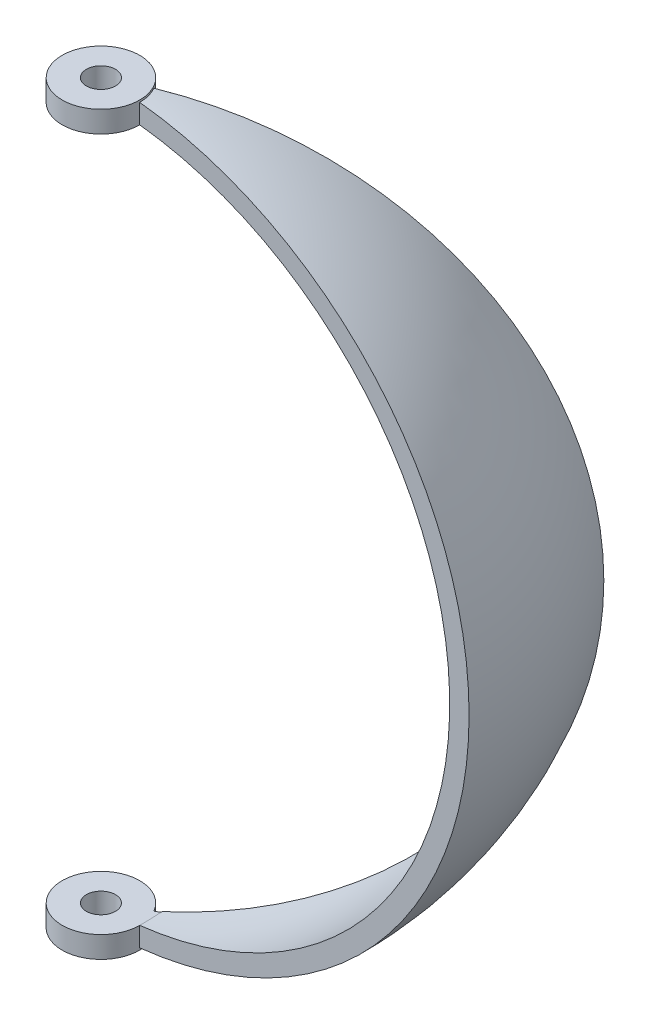
ISO-10303-21;
HEADER;
FILE_DESCRIPTION(('STEP AP214'),'2;1');
FILE_NAME('part.step','',(''),(''),'','','');
FILE_SCHEMA(('AUTOMOTIVE_DESIGN { 1 0 10303 214 1 1 1 1 }'));
ENDSEC;
DATA;
#1=APPLICATION_CONTEXT('core data for automotive mechanical design processes');
#2=APPLICATION_PROTOCOL_DEFINITION('international standard','automotive_design',2000,#1);
#3=PRODUCT_CONTEXT('',#1,'mechanical');
#4=PRODUCT('Part','Part','',(#3));
#5=PRODUCT_RELATED_PRODUCT_CATEGORY('part','',(#4));
#6=PRODUCT_DEFINITION_FORMATION('','',#4);
#7=PRODUCT_DEFINITION_CONTEXT('part definition',#1,'design');
#8=PRODUCT_DEFINITION('design','',#6,#7);
#9=PRODUCT_DEFINITION_SHAPE('','',#8);
#10=(LENGTH_UNIT() NAMED_UNIT(*) SI_UNIT(.MILLI.,.METRE.));
#11=(NAMED_UNIT(*) PLANE_ANGLE_UNIT() SI_UNIT($,.RADIAN.));
#12=(NAMED_UNIT(*) SI_UNIT($,.STERADIAN.) SOLID_ANGLE_UNIT());
#13=UNCERTAINTY_MEASURE_WITH_UNIT(LENGTH_MEASURE(1.E-05),#10,'distance_accuracy_value','');
#14=(GEOMETRIC_REPRESENTATION_CONTEXT(3) GLOBAL_UNCERTAINTY_ASSIGNED_CONTEXT((#13)) GLOBAL_UNIT_ASSIGNED_CONTEXT((#10,
#11,#12)) REPRESENTATION_CONTEXT('',''));
#15=CARTESIAN_POINT('',(0.,0.,0.));
#16=DIRECTION('',(0.,0.,1.));
#17=DIRECTION('',(1.,0.,0.));
#18=AXIS2_PLACEMENT_3D('',#15,#16,#17);
#19=CARTESIAN_POINT('',(0.,48.26,0.));
#20=DIRECTION('',(0.,-1.,0.));
#21=DIRECTION('',(0.,0.,-1.));
#22=AXIS2_PLACEMENT_3D('',#19,#20,#21);
#23=CYLINDRICAL_SURFACE('',#22,5.08);
#24=CARTESIAN_POINT('',(0.,48.26,0.));
#25=DIRECTION('',(0.,1.,0.));
#26=DIRECTION('',(0.,0.,1.));
#27=AXIS2_PLACEMENT_3D('',#24,#25,#26);
#28=CIRCLE('',#27,5.08);
#29=CARTESIAN_POINT('',(0.,48.26,5.08));
#30=VERTEX_POINT('',#29);
#31=EDGE_CURVE('E148',#30,#30,#28,.T.);
#32=ORIENTED_EDGE('',*,*,#31,.F.);
#33=EDGE_LOOP('',(#32));
#34=FACE_BOUND('',#33,.T.);
#35=DIRECTION('',(0.,-1.,0.));
#36=VECTOR('',#35,1.);
#37=CARTESIAN_POINT('',(4.39940905122495,48.26,-2.53999999999999));
#38=LINE('',#37,#36);
#39=CARTESIAN_POINT('',(4.39940905122489,47.9918868143356,-2.53999999999999));
#40=VERTEX_POINT('',#39);
#41=CARTESIAN_POINT('',(4.39940905122489,45.4369013027957,-2.53999999999999));
#42=VERTEX_POINT('',#41);
#43=EDGE_CURVE('E126',#40,#42,#38,.T.);
#44=ORIENTED_EDGE('',*,*,#43,.T.);
#45=CARTESIAN_POINT('',(0.,45.4369013027957,0.));
#46=DIRECTION('',(0.,-1.,0.));
#47=DIRECTION('',(0.,0.,-1.));
#48=AXIS2_PLACEMENT_3D('',#45,#46,#47);
#49=CIRCLE('',#48,5.08);
#50=CARTESIAN_POINT('',(5.08,45.4369013027957,0.));
#51=VERTEX_POINT('',#50);
#52=EDGE_CURVE('E92',#51,#42,#49,.T.);
#53=ORIENTED_EDGE('',*,*,#52,.F.);
#54=DIRECTION('',(0.,-1.,0.));
#55=VECTOR('',#54,1.);
#56=CARTESIAN_POINT('',(5.08,48.26,0.));
#57=LINE('',#56,#55);
#58=CARTESIAN_POINT('',(5.08,47.9918868143356,0.));
#59=VERTEX_POINT('',#58);
#60=EDGE_CURVE('E120',#59,#51,#57,.T.);
#61=ORIENTED_EDGE('',*,*,#60,.F.);
#62=CARTESIAN_POINT('',(0.,47.9918868143356,0.));
#63=DIRECTION('',(0.,-1.,0.));
#64=DIRECTION('',(0.,0.,-1.));
#65=AXIS2_PLACEMENT_3D('',#62,#63,#64);
#66=CIRCLE('',#65,5.08);
#67=EDGE_CURVE('E130',#40,#59,#66,.T.);
#68=ORIENTED_EDGE('',*,*,#67,.F.);
#69=EDGE_LOOP('',(#44,#53,#61,#68));
#70=FACE_BOUND('',#69,.T.);
#71=ADVANCED_FACE('F36',(#34,#70),#23,.T.);
#72=CARTESIAN_POINT('',(0.,-48.26,0.));
#73=DIRECTION('',(0.,1.,0.));
#74=DIRECTION('',(0.,0.,1.));
#75=AXIS2_PLACEMENT_3D('',#72,#73,#74);
#76=CIRCLE('',#75,5.08);
#77=CARTESIAN_POINT('',(0.,-48.26,5.08));
#78=VERTEX_POINT('',#77);
#79=EDGE_CURVE('E153',#78,#78,#76,.T.);
#80=ORIENTED_EDGE('',*,*,#79,.T.);
#81=EDGE_LOOP('',(#80));
#82=FACE_BOUND('',#81,.T.);
#83=CARTESIAN_POINT('',(0.,-45.4369013027957,0.));
#84=DIRECTION('',(0.,1.,0.));
#85=DIRECTION('',(-1.,0.,0.));
#86=AXIS2_PLACEMENT_3D('',#83,#84,#85);
#87=CIRCLE('',#86,5.08);
#88=CARTESIAN_POINT('',(4.39940905122494,-45.4369013027957,-2.53999999999999));
#89=VERTEX_POINT('',#88);
#90=CARTESIAN_POINT('',(5.08,-45.4369013027957,0.));
#91=VERTEX_POINT('',#90);
#92=EDGE_CURVE('E88',#89,#91,#87,.T.);
#93=ORIENTED_EDGE('',*,*,#92,.F.);
#94=CARTESIAN_POINT('',(4.399409051225,-47.9918868143356,-2.54000000000004));
#95=VERTEX_POINT('',#94);
#96=EDGE_CURVE('E132',#89,#95,#38,.T.);
#97=ORIENTED_EDGE('',*,*,#96,.T.);
#98=CARTESIAN_POINT('',(0.,-47.9918868143356,0.));
#99=DIRECTION('',(0.,1.,0.));
#100=DIRECTION('',(0.,0.,1.));
#101=AXIS2_PLACEMENT_3D('',#98,#99,#100);
#102=CIRCLE('',#101,5.08);
#103=CARTESIAN_POINT('',(5.08,-47.9918868143356,0.));
#104=VERTEX_POINT('',#103);
#105=EDGE_CURVE('E60',#104,#95,#102,.T.);
#106=ORIENTED_EDGE('',*,*,#105,.F.);
#107=EDGE_CURVE('E115',#91,#104,#57,.T.);
#108=ORIENTED_EDGE('',*,*,#107,.F.);
#109=EDGE_LOOP('',(#93,#97,#106,#108));
#110=FACE_BOUND('',#109,.T.);
#111=ADVANCED_FACE('F116',(#82,#110),#23,.T.);
#112=CARTESIAN_POINT('',(0.,0.,0.));
#113=DIRECTION('',(0.,-1.,0.));
#114=DIRECTION('',(-0.866025403784438,0.,0.500000000000001));
#115=AXIS2_PLACEMENT_3D('',#112,#113,#114);
#116=SPHERICAL_SURFACE('',#115,45.72);
#117=CARTESIAN_POINT('',(5.08,0.,0.));
#118=DIRECTION('',(-1.,0.,0.));
#119=DIRECTION('',(0.,0.,1.));
#120=AXIS2_PLACEMENT_3D('',#117,#118,#119);
#121=CIRCLE('',#120,45.4369013027957);
#122=CARTESIAN_POINT('',(5.08,-45.3421422813994,-2.93293936748329));
#123=VERTEX_POINT('',#122);
#124=EDGE_CURVE('E98',#91,#123,#121,.F.);
#125=ORIENTED_EDGE('',*,*,#124,.F.);
#126=CARTESIAN_POINT('',(0.,0.,0.));
#127=DIRECTION('',(0.,0.,1.));
#128=DIRECTION('',(1.,0.,0.));
#129=AXIS2_PLACEMENT_3D('',#126,#127,#128);
#130=CIRCLE('',#129,45.72);
#131=EDGE_CURVE('E110',#91,#51,#130,.T.);
#132=ORIENTED_EDGE('',*,*,#131,.T.);
#133=CARTESIAN_POINT('',(5.08,45.3421422813994,-2.93293936748329));
#134=VERTEX_POINT('',#133);
#135=EDGE_CURVE('E113',#134,#51,#121,.F.);
#136=ORIENTED_EDGE('',*,*,#135,.F.);
#137=CARTESIAN_POINT('',(0.,0.,0.));
#138=DIRECTION('',(0.500000000000001,0.,0.866025403784438));
#139=DIRECTION('',(0.866025403784438,0.,-0.500000000000001));
#140=AXIS2_PLACEMENT_3D('',#137,#138,#139);
#141=CIRCLE('',#140,45.72);
#142=EDGE_CURVE('E112',#123,#134,#141,.T.);
#143=ORIENTED_EDGE('',*,*,#142,.F.);
#144=EDGE_LOOP('',(#125,#132,#136,#143));
#145=FACE_BOUND('',#144,.T.);
#146=ADVANCED_FACE('F107',(#145),#116,.F.);
#147=CARTESIAN_POINT('',(0.,0.,0.));
#148=DIRECTION('',(0.500000000000001,0.,0.866025403784438));
#149=DIRECTION('',(0.866025403784438,0.,-0.500000000000001));
#150=AXIS2_PLACEMENT_3D('',#147,#148,#149);
#151=PLANE('',#150);
#152=DIRECTION('',(0.,-1.,0.));
#153=VECTOR('',#152,1.);
#154=CARTESIAN_POINT('',(5.08,0.,-2.93293936748329));
#155=LINE('',#154,#153);
#156=CARTESIAN_POINT('',(5.07999999999999,45.4369013027957,-2.93293936748329));
#157=VERTEX_POINT('',#156);
#158=EDGE_CURVE('E93',#157,#134,#155,.T.);
#159=ORIENTED_EDGE('',*,*,#158,.F.);
#160=DIRECTION('',(0.866025403784438,0.,-0.500000000000001));
#161=VECTOR('',#160,1.);
#162=CARTESIAN_POINT('',(0.,45.4369013027957,0.));
#163=LINE('',#162,#161);
#164=EDGE_CURVE('E11',#42,#157,#163,.T.);
#165=ORIENTED_EDGE('',*,*,#164,.F.);
#166=ORIENTED_EDGE('',*,*,#43,.F.);
#167=CARTESIAN_POINT('',(0.,0.,0.));
#168=DIRECTION('',(0.500000000000001,0.,0.866025403784438));
#169=DIRECTION('',(0.866025403784438,0.,-0.500000000000001));
#170=AXIS2_PLACEMENT_3D('',#167,#168,#169);
#171=CIRCLE('',#170,48.26);
#172=EDGE_CURVE('E121',#95,#40,#171,.T.);
#173=ORIENTED_EDGE('',*,*,#172,.F.);
#174=ORIENTED_EDGE('',*,*,#96,.F.);
#175=DIRECTION('',(-0.866025403784438,0.,0.500000000000001));
#176=VECTOR('',#175,1.);
#177=CARTESIAN_POINT('',(0.,-45.4369013027957,0.));
#178=LINE('',#177,#176);
#179=CARTESIAN_POINT('',(5.07999999999999,-45.4369013027957,-2.93293936748329));
#180=VERTEX_POINT('',#179);
#181=EDGE_CURVE('E45',#180,#89,#178,.T.);
#182=ORIENTED_EDGE('',*,*,#181,.F.);
#183=EDGE_CURVE('E100',#123,#180,#155,.T.);
#184=ORIENTED_EDGE('',*,*,#183,.F.);
#185=ORIENTED_EDGE('',*,*,#142,.T.);
#186=EDGE_LOOP('',(#159,#165,#166,#173,#174,#182,#184,#185));
#187=FACE_BOUND('',#186,.T.);
#188=ADVANCED_FACE('F144',(#187),#151,.F.);
#189=CARTESIAN_POINT('',(0.,48.26,0.));
#190=DIRECTION('',(0.,1.,0.));
#191=DIRECTION('',(0.,0.,1.));
#192=AXIS2_PLACEMENT_3D('',#189,#190,#191);
#193=PLANE('',#192);
#194=CARTESIAN_POINT('',(0.,48.26,0.));
#195=DIRECTION('',(0.,1.,0.));
#196=DIRECTION('',(0.,0.,1.));
#197=AXIS2_PLACEMENT_3D('',#194,#195,#196);
#198=CIRCLE('',#197,1.905);
#199=CARTESIAN_POINT('',(0.,48.26,1.905));
#200=VERTEX_POINT('',#199);
#201=EDGE_CURVE('E102',#200,#200,#198,.T.);
#202=ORIENTED_EDGE('',*,*,#201,.F.);
#203=EDGE_LOOP('',(#202));
#204=FACE_BOUND('',#203,.T.);
#205=ORIENTED_EDGE('',*,*,#31,.T.);
#206=EDGE_LOOP('',(#205));
#207=FACE_BOUND('',#206,.T.);
#208=ADVANCED_FACE('F201',(#204,#207),#193,.T.);
#209=CARTESIAN_POINT('',(0.,-48.26,0.));
#210=DIRECTION('',(0.,1.,0.));
#211=DIRECTION('',(0.,0.,1.));
#212=AXIS2_PLACEMENT_3D('',#209,#210,#211);
#213=PLANE('',#212);
#214=CARTESIAN_POINT('',(0.,-48.26,0.));
#215=DIRECTION('',(0.,1.,0.));
#216=DIRECTION('',(0.,0.,1.));
#217=AXIS2_PLACEMENT_3D('',#214,#215,#216);
#218=CIRCLE('',#217,1.905);
#219=CARTESIAN_POINT('',(0.,-48.26,1.905));
#220=VERTEX_POINT('',#219);
#221=EDGE_CURVE('E165',#220,#220,#218,.T.);
#222=ORIENTED_EDGE('',*,*,#221,.T.);
#223=EDGE_LOOP('',(#222));
#224=FACE_BOUND('',#223,.T.);
#225=ORIENTED_EDGE('',*,*,#79,.F.);
#226=EDGE_LOOP('',(#225));
#227=FACE_BOUND('',#226,.T.);
#228=ADVANCED_FACE('F220',(#224,#227),#213,.F.);
#229=CARTESIAN_POINT('',(0.,0.,0.));
#230=DIRECTION('',(0.,-1.,0.));
#231=DIRECTION('',(-0.866025403784438,0.,0.500000000000001));
#232=AXIS2_PLACEMENT_3D('',#229,#230,#231);
#233=SPHERICAL_SURFACE('',#232,48.26);
#234=CARTESIAN_POINT('',(0.,0.,0.));
#235=DIRECTION('',(0.,0.,1.));
#236=DIRECTION('',(1.,0.,0.));
#237=AXIS2_PLACEMENT_3D('',#234,#235,#236);
#238=CIRCLE('',#237,48.26);
#239=EDGE_CURVE('E125',#104,#59,#238,.T.);
#240=ORIENTED_EDGE('',*,*,#239,.F.);
#241=ORIENTED_EDGE('',*,*,#105,.T.);
#242=ORIENTED_EDGE('',*,*,#172,.T.);
#243=ORIENTED_EDGE('',*,*,#67,.T.);
#244=EDGE_LOOP('',(#240,#241,#242,#243));
#245=FACE_BOUND('',#244,.T.);
#246=ADVANCED_FACE('F38',(#245),#233,.T.);
#247=CARTESIAN_POINT('',(0.,0.,0.));
#248=DIRECTION('',(0.,0.,1.));
#249=DIRECTION('',(1.,0.,0.));
#250=AXIS2_PLACEMENT_3D('',#247,#248,#249);
#251=PLANE('',#250);
#252=ORIENTED_EDGE('',*,*,#239,.T.);
#253=ORIENTED_EDGE('',*,*,#60,.T.);
#254=ORIENTED_EDGE('',*,*,#131,.F.);
#255=ORIENTED_EDGE('',*,*,#107,.T.);
#256=EDGE_LOOP('',(#252,#253,#254,#255));
#257=FACE_BOUND('',#256,.T.);
#258=ADVANCED_FACE('F124',(#257),#251,.T.);
#259=CARTESIAN_POINT('',(5.08,45.4369013027957,40.386));
#260=DIRECTION('',(-1.,0.,0.));
#261=DIRECTION('',(0.,0.,1.));
#262=AXIS2_PLACEMENT_3D('',#259,#260,#261);
#263=PLANE('',#262);
#264=ORIENTED_EDGE('',*,*,#124,.T.);
#265=ORIENTED_EDGE('',*,*,#183,.T.);
#266=DIRECTION('',(0.,0.,-1.));
#267=VECTOR('',#266,1.);
#268=CARTESIAN_POINT('',(5.08,-45.4369013027957,40.386));
#269=LINE('',#268,#267);
#270=EDGE_CURVE('E52',#91,#180,#269,.T.);
#271=ORIENTED_EDGE('',*,*,#270,.F.);
#272=EDGE_LOOP('',(#264,#265,#271));
#273=FACE_BOUND('',#272,.T.);
#274=ADVANCED_FACE('F97',(#273),#263,.T.);
#275=CARTESIAN_POINT('',(5.08,-45.4369013027957,40.386));
#276=DIRECTION('',(0.,1.,0.));
#277=DIRECTION('',(-1.,0.,0.));
#278=AXIS2_PLACEMENT_3D('',#275,#276,#277);
#279=PLANE('',#278);
#280=CARTESIAN_POINT('',(0.,-45.4369013027957,0.));
#281=DIRECTION('',(0.,1.,0.));
#282=DIRECTION('',(-1.,0.,0.));
#283=AXIS2_PLACEMENT_3D('',#280,#281,#282);
#284=CIRCLE('',#283,1.905);
#285=CARTESIAN_POINT('',(0.,-45.4369013027957,1.905));
#286=VERTEX_POINT('',#285);
#287=EDGE_CURVE('E162',#286,#286,#284,.T.);
#288=ORIENTED_EDGE('',*,*,#287,.F.);
#289=EDGE_LOOP('',(#288));
#290=FACE_BOUND('',#289,.T.);
#291=ORIENTED_EDGE('',*,*,#92,.T.);
#292=ORIENTED_EDGE('',*,*,#270,.T.);
#293=ORIENTED_EDGE('',*,*,#181,.T.);
#294=EDGE_LOOP('',(#291,#292,#293));
#295=FACE_BOUND('',#294,.T.);
#296=ADVANCED_FACE('F89',(#290,#295),#279,.T.);
#297=CARTESIAN_POINT('',(5.08,45.4369013027957,40.386));
#298=DIRECTION('',(0.,-1.,0.));
#299=DIRECTION('',(0.,0.,-1.));
#300=AXIS2_PLACEMENT_3D('',#297,#298,#299);
#301=PLANE('',#300);
#302=CARTESIAN_POINT('',(0.,45.4369013027957,0.));
#303=DIRECTION('',(0.,-1.,0.));
#304=DIRECTION('',(0.,0.,-1.));
#305=AXIS2_PLACEMENT_3D('',#302,#303,#304);
#306=CIRCLE('',#305,1.905);
#307=CARTESIAN_POINT('',(0.,45.4369013027957,1.905));
#308=VERTEX_POINT('',#307);
#309=EDGE_CURVE('E40',#308,#308,#306,.T.);
#310=ORIENTED_EDGE('',*,*,#309,.F.);
#311=EDGE_LOOP('',(#310));
#312=FACE_BOUND('',#311,.T.);
#313=ORIENTED_EDGE('',*,*,#52,.T.);
#314=ORIENTED_EDGE('',*,*,#164,.T.);
#315=DIRECTION('',(0.,0.,-1.));
#316=VECTOR('',#315,1.);
#317=CARTESIAN_POINT('',(5.08,45.4369013027957,40.386));
#318=LINE('',#317,#316);
#319=EDGE_CURVE('E101',#51,#157,#318,.T.);
#320=ORIENTED_EDGE('',*,*,#319,.F.);
#321=EDGE_LOOP('',(#313,#314,#320));
#322=FACE_BOUND('',#321,.T.);
#323=ADVANCED_FACE('F174',(#312,#322),#301,.T.);
#324=ORIENTED_EDGE('',*,*,#158,.T.);
#325=ORIENTED_EDGE('',*,*,#135,.T.);
#326=ORIENTED_EDGE('',*,*,#319,.T.);
#327=EDGE_LOOP('',(#324,#325,#326));
#328=FACE_BOUND('',#327,.T.);
#329=ADVANCED_FACE('F177',(#328),#263,.T.);
#330=CARTESIAN_POINT('',(0.,-48.26,0.));
#331=DIRECTION('',(0.,1.,0.));
#332=DIRECTION('',(0.,0.,1.));
#333=AXIS2_PLACEMENT_3D('',#330,#331,#332);
#334=CYLINDRICAL_SURFACE('',#333,1.905);
#335=CARTESIAN_POINT('',(0.,48.26,1.905));
#336=CARTESIAN_POINT('',(0.,48.2305927219041,1.905));
#337=CARTESIAN_POINT('',(0.,48.2011854438082,1.905));
#338=CARTESIAN_POINT('',(0.,48.1423708876165,1.905));
#339=CARTESIAN_POINT('',(0.,48.1129636095206,1.905));
#340=CARTESIAN_POINT('',(0.,48.0541490533288,1.905));
#341=CARTESIAN_POINT('',(0.,48.024741775233,1.905));
#342=CARTESIAN_POINT('',(0.,47.9659272190412,1.905));
#343=CARTESIAN_POINT('',(0.,47.9365199409453,1.905));
#344=CARTESIAN_POINT('',(0.,47.8777053847536,1.905));
#345=CARTESIAN_POINT('',(0.,47.8482981066577,1.905));
#346=CARTESIAN_POINT('',(0.,47.7894835504659,1.905));
#347=CARTESIAN_POINT('',(0.,47.7600762723701,1.905));
#348=CARTESIAN_POINT('',(0.,47.7012617161783,1.905));
#349=CARTESIAN_POINT('',(0.,47.6718544380824,1.905));
#350=CARTESIAN_POINT('',(0.,47.6130398818907,1.905));
#351=CARTESIAN_POINT('',(0.,47.5836326037948,1.905));
#352=CARTESIAN_POINT('',(0.,47.524818047603,1.905));
#353=CARTESIAN_POINT('',(0.,47.4954107695072,1.905));
#354=CARTESIAN_POINT('',(0.,47.4365962133154,1.905));
#355=CARTESIAN_POINT('',(0.,47.4071889352195,1.905));
#356=CARTESIAN_POINT('',(0.,47.3483743790278,1.905));
#357=CARTESIAN_POINT('',(0.,47.3189671009319,1.905));
#358=CARTESIAN_POINT('',(0.,47.2601525447401,1.905));
#359=CARTESIAN_POINT('',(0.,47.2307452666443,1.905));
#360=CARTESIAN_POINT('',(0.,47.1719307104525,1.905));
#361=CARTESIAN_POINT('',(0.,47.1425234323566,1.905));
#362=CARTESIAN_POINT('',(0.,47.0837088761649,1.905));
#363=CARTESIAN_POINT('',(0.,47.054301598069,1.905));
#364=CARTESIAN_POINT('',(0.,46.9954870418772,1.905));
#365=CARTESIAN_POINT('',(0.,46.9660797637814,1.905));
#366=CARTESIAN_POINT('',(0.,46.9072652075896,1.905));
#367=CARTESIAN_POINT('',(0.,46.8778579294937,1.905));
#368=CARTESIAN_POINT('',(0.,46.819043373302,1.905));
#369=CARTESIAN_POINT('',(0.,46.7896360952061,1.905));
#370=CARTESIAN_POINT('',(0.,46.7308215390143,1.905));
#371=CARTESIAN_POINT('',(0.,46.7014142609185,1.905));
#372=CARTESIAN_POINT('',(0.,46.6425997047267,1.905));
#373=CARTESIAN_POINT('',(0.,46.6131924266308,1.905));
#374=CARTESIAN_POINT('',(0.,46.5543778704391,1.905));
#375=CARTESIAN_POINT('',(0.,46.5249705923432,1.905));
#376=CARTESIAN_POINT('',(0.,46.4661560361514,1.905));
#377=CARTESIAN_POINT('',(0.,46.4367487580556,1.905));
#378=CARTESIAN_POINT('',(0.,46.3779342018638,1.905));
#379=CARTESIAN_POINT('',(0.,46.3485269237679,1.905));
#380=CARTESIAN_POINT('',(0.,46.2897123675762,1.905));
#381=CARTESIAN_POINT('',(0.,46.2603050894803,1.905));
#382=CARTESIAN_POINT('',(0.,46.2014905332885,1.905));
#383=CARTESIAN_POINT('',(0.,46.1720832551927,1.905));
#384=CARTESIAN_POINT('',(0.,46.1132686990009,1.905));
#385=CARTESIAN_POINT('',(0.,46.083861420905,1.905));
#386=CARTESIAN_POINT('',(0.,46.0250468647133,1.905));
#387=CARTESIAN_POINT('',(0.,45.9956395866174,1.905));
#388=CARTESIAN_POINT('',(0.,45.9368250304256,1.905));
#389=CARTESIAN_POINT('',(0.,45.9074177523298,1.905));
#390=CARTESIAN_POINT('',(0.,45.848603196138,1.905));
#391=CARTESIAN_POINT('',(0.,45.8191959180421,1.905));
#392=CARTESIAN_POINT('',(0.,45.7603813618504,1.905));
#393=CARTESIAN_POINT('',(0.,45.7309740837545,1.905));
#394=CARTESIAN_POINT('',(0.,45.6721595275627,1.905));
#395=CARTESIAN_POINT('',(0.,45.6427522494669,1.905));
#396=CARTESIAN_POINT('',(0.,45.5839376932751,1.905));
#397=CARTESIAN_POINT('',(0.,45.5545304151792,1.905));
#398=CARTESIAN_POINT('',(0.,45.4957158589875,1.905));
#399=CARTESIAN_POINT('',(0.,45.4663085808916,1.905));
#400=CARTESIAN_POINT('',(0.,45.4369013027957,1.905));
#401=B_SPLINE_CURVE_WITH_KNOTS('',3,(#335,#336,#337,#338,#339,#340,#341,#342,#343,#344,#345,
#346,#347,#348,#349,#350,#351,#352,#353,#354,#355,#356,#357,#358,#359,#360,#361,#362,#363,#364,
#365,#366,#367,#368,#369,#370,#371,#372,#373,#374,#375,#376,#377,#378,#379,#380,#381,#382,#383,
#384,#385,#386,#387,#388,#389,#390,#391,#392,#393,#394,#395,#396,#397,#398,#399,#400),
.UNSPECIFIED.,.F.,.F.,(4,2,2,2,2,2,2,2,2,2,2,2,2,2,2,2,2,2,2,2,2,2,2,2,2,2,2,2,2,2,2,2,4),(0.,
0.0882218342876384,0.176443668575263,0.264665502862901,0.352887337150526,0.441109171438164,
0.529331005725803,0.617552840013427,0.705774674301066,0.793996508588704,0.882218342876329,
0.970440177163967,1.05866201145161,1.14688384573923,1.23510568002687,1.32332751431449,
1.41154934860213,1.49977118288977,1.58799301717739,1.67621485146503,1.76443668575266,
1.8526585200403,1.94088035432793,2.02910218861556,2.1173240229032,2.20554585719084,
2.29376769147846,2.3819895257661,2.47021136005374,2.55843319434136,2.646655028629,
2.73487686291662,2.82309869720426),.UNSPECIFIED.);
#402=EDGE_CURVE('BSEAM172',#200,#308,#401,.T.);
#403=ORIENTED_EDGE('',*,*,#201,.T.);
#404=ORIENTED_EDGE('',*,*,#309,.T.);
#405=ORIENTED_EDGE('',*,*,#402,.T.);
#406=ORIENTED_EDGE('',*,*,#402,.F.);
#407=EDGE_LOOP('',(#403,#405,#404,#406));
#408=FACE_BOUND('',#407,.T.);
#409=ADVANCED_FACE('F172',(#408),#334,.F.);
#410=CARTESIAN_POINT('',(0.,-45.4369013027957,1.905));
#411=CARTESIAN_POINT('',(0.,-45.4663085808916,1.905));
#412=CARTESIAN_POINT('',(0.,-45.4957158589875,1.905));
#413=CARTESIAN_POINT('',(0.,-45.5545304151792,1.905));
#414=CARTESIAN_POINT('',(0.,-45.5839376932751,1.905));
#415=CARTESIAN_POINT('',(0.,-45.6427522494669,1.905));
#416=CARTESIAN_POINT('',(0.,-45.6721595275627,1.905));
#417=CARTESIAN_POINT('',(0.,-45.7309740837545,1.905));
#418=CARTESIAN_POINT('',(0.,-45.7603813618504,1.905));
#419=CARTESIAN_POINT('',(0.,-45.8191959180421,1.905));
#420=CARTESIAN_POINT('',(0.,-45.848603196138,1.905));
#421=CARTESIAN_POINT('',(0.,-45.9074177523298,1.905));
#422=CARTESIAN_POINT('',(0.,-45.9368250304256,1.905));
#423=CARTESIAN_POINT('',(0.,-45.9956395866174,1.905));
#424=CARTESIAN_POINT('',(0.,-46.0250468647133,1.905));
#425=CARTESIAN_POINT('',(0.,-46.083861420905,1.905));
#426=CARTESIAN_POINT('',(0.,-46.1132686990009,1.905));
#427=CARTESIAN_POINT('',(0.,-46.1720832551927,1.905));
#428=CARTESIAN_POINT('',(0.,-46.2014905332885,1.905));
#429=CARTESIAN_POINT('',(0.,-46.2603050894803,1.905));
#430=CARTESIAN_POINT('',(0.,-46.2897123675762,1.905));
#431=CARTESIAN_POINT('',(0.,-46.3485269237679,1.905));
#432=CARTESIAN_POINT('',(0.,-46.3779342018638,1.905));
#433=CARTESIAN_POINT('',(0.,-46.4367487580556,1.905));
#434=CARTESIAN_POINT('',(0.,-46.4661560361514,1.905));
#435=CARTESIAN_POINT('',(0.,-46.5249705923432,1.905));
#436=CARTESIAN_POINT('',(0.,-46.5543778704391,1.905));
#437=CARTESIAN_POINT('',(0.,-46.6131924266308,1.905));
#438=CARTESIAN_POINT('',(0.,-46.6425997047267,1.905));
#439=CARTESIAN_POINT('',(0.,-46.7014142609185,1.905));
#440=CARTESIAN_POINT('',(0.,-46.7308215390143,1.905));
#441=CARTESIAN_POINT('',(0.,-46.7896360952061,1.905));
#442=CARTESIAN_POINT('',(0.,-46.819043373302,1.905));
#443=CARTESIAN_POINT('',(0.,-46.8778579294937,1.905));
#444=CARTESIAN_POINT('',(0.,-46.9072652075896,1.905));
#445=CARTESIAN_POINT('',(0.,-46.9660797637814,1.905));
#446=CARTESIAN_POINT('',(0.,-46.9954870418772,1.905));
#447=CARTESIAN_POINT('',(0.,-47.054301598069,1.905));
#448=CARTESIAN_POINT('',(0.,-47.0837088761649,1.905));
#449=CARTESIAN_POINT('',(0.,-47.1425234323566,1.905));
#450=CARTESIAN_POINT('',(0.,-47.1719307104525,1.905));
#451=CARTESIAN_POINT('',(0.,-47.2307452666443,1.905));
#452=CARTESIAN_POINT('',(0.,-47.2601525447402,1.905));
#453=CARTESIAN_POINT('',(0.,-47.3189671009319,1.905));
#454=CARTESIAN_POINT('',(0.,-47.3483743790278,1.905));
#455=CARTESIAN_POINT('',(0.,-47.4071889352195,1.905));
#456=CARTESIAN_POINT('',(0.,-47.4365962133154,1.905));
#457=CARTESIAN_POINT('',(0.,-47.4954107695072,1.905));
#458=CARTESIAN_POINT('',(0.,-47.524818047603,1.905));
#459=CARTESIAN_POINT('',(0.,-47.5836326037948,1.905));
#460=CARTESIAN_POINT('',(0.,-47.6130398818907,1.905));
#461=CARTESIAN_POINT('',(0.,-47.6718544380824,1.905));
#462=CARTESIAN_POINT('',(0.,-47.7012617161783,1.905));
#463=CARTESIAN_POINT('',(0.,-47.7600762723701,1.905));
#464=CARTESIAN_POINT('',(0.,-47.789483550466,1.905));
#465=CARTESIAN_POINT('',(0.,-47.8482981066577,1.905));
#466=CARTESIAN_POINT('',(0.,-47.8777053847536,1.905));
#467=CARTESIAN_POINT('',(0.,-47.9365199409453,1.905));
#468=CARTESIAN_POINT('',(0.,-47.9659272190412,1.905));
#469=CARTESIAN_POINT('',(0.,-48.024741775233,1.905));
#470=CARTESIAN_POINT('',(0.,-48.0541490533288,1.905));
#471=CARTESIAN_POINT('',(0.,-48.1129636095206,1.905));
#472=CARTESIAN_POINT('',(0.,-48.1423708876165,1.905));
#473=CARTESIAN_POINT('',(0.,-48.2011854438082,1.905));
#474=CARTESIAN_POINT('',(0.,-48.2305927219041,1.905));
#475=CARTESIAN_POINT('',(0.,-48.26,1.905));
#476=B_SPLINE_CURVE_WITH_KNOTS('',3,(#410,#411,#412,#413,#414,#415,#416,#417,#418,#419,#420,
#421,#422,#423,#424,#425,#426,#427,#428,#429,#430,#431,#432,#433,#434,#435,#436,#437,#438,#439,
#440,#441,#442,#443,#444,#445,#446,#447,#448,#449,#450,#451,#452,#453,#454,#455,#456,#457,#458,
#459,#460,#461,#462,#463,#464,#465,#466,#467,#468,#469,#470,#471,#472,#473,#474,#475),
.UNSPECIFIED.,.F.,.F.,(4,2,2,2,2,2,2,2,2,2,2,2,2,2,2,2,2,2,2,2,2,2,2,2,2,2,2,2,2,2,2,2,4),(0.,
0.0882218342876315,0.176443668575263,0.264665502862901,0.352887337150533,0.441109171438164,
0.529331005725803,0.617552840013434,0.705774674301073,0.793996508588704,0.882218342876335,
0.970440177163974,1.05866201145161,1.14688384573924,1.23510568002688,1.32332751431451,
1.41154934860215,1.49977118288978,1.58799301717741,1.67621485146505,1.76443668575268,
1.85265852004031,1.94088035432795,2.02910218861558,2.11732402290322,2.20554585719085,
2.29376769147848,2.38198952576612,2.47021136005375,2.55843319434138,2.64665502862902,
2.73487686291665,2.82309869720428),.UNSPECIFIED.);
#477=EDGE_CURVE('BSEAM186',#286,#220,#476,.T.);
#478=ORIENTED_EDGE('',*,*,#287,.T.);
#479=ORIENTED_EDGE('',*,*,#221,.F.);
#480=ORIENTED_EDGE('',*,*,#477,.T.);
#481=ORIENTED_EDGE('',*,*,#477,.F.);
#482=EDGE_LOOP('',(#478,#480,#479,#481));
#483=FACE_BOUND('',#482,.T.);
#484=ADVANCED_FACE('F186',(#483),#334,.F.);
#485=CLOSED_SHELL('',(#71,#111,#146,#188,#208,#228,#246,#258,#274,#296,#323,#329,#409,#484));
#486=MANIFOLD_SOLID_BREP('B2',#485);
#487=ADVANCED_BREP_SHAPE_REPRESENTATION('',(#18,#486),#14);
#488=SHAPE_DEFINITION_REPRESENTATION(#9,#487);
ENDSEC;
END-ISO-10303-21;
